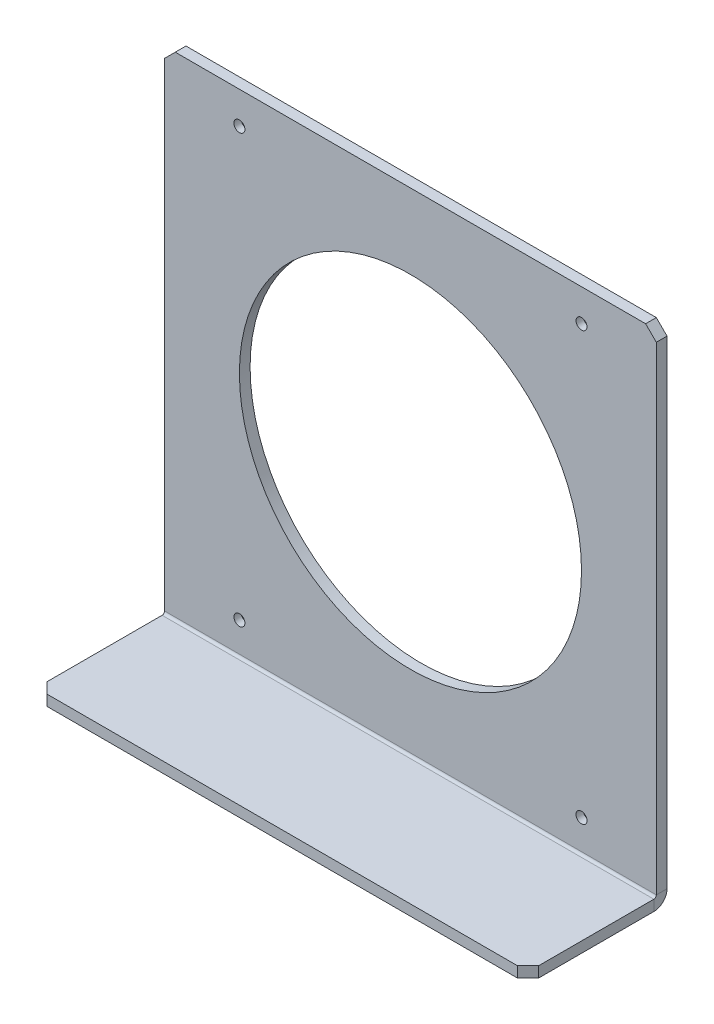
ISO-10303-21;
HEADER;
FILE_DESCRIPTION(('STEP AP214'),'2;1');
FILE_NAME('part.step','',(''),(''),'','','');
FILE_SCHEMA(('AUTOMOTIVE_DESIGN { 1 0 10303 214 1 1 1 1 }'));
ENDSEC;
DATA;
#1=APPLICATION_CONTEXT('core data for automotive mechanical design processes');
#2=APPLICATION_PROTOCOL_DEFINITION('international standard','automotive_design',2000,#1);
#3=PRODUCT_CONTEXT('',#1,'mechanical');
#4=PRODUCT('Part','Part','',(#3));
#5=PRODUCT_RELATED_PRODUCT_CATEGORY('part','',(#4));
#6=PRODUCT_DEFINITION_FORMATION('','',#4);
#7=PRODUCT_DEFINITION_CONTEXT('part definition',#1,'design');
#8=PRODUCT_DEFINITION('design','',#6,#7);
#9=PRODUCT_DEFINITION_SHAPE('','',#8);
#10=(LENGTH_UNIT() NAMED_UNIT(*) SI_UNIT(.MILLI.,.METRE.));
#11=(NAMED_UNIT(*) PLANE_ANGLE_UNIT() SI_UNIT($,.RADIAN.));
#12=(NAMED_UNIT(*) SI_UNIT($,.STERADIAN.) SOLID_ANGLE_UNIT());
#13=UNCERTAINTY_MEASURE_WITH_UNIT(LENGTH_MEASURE(1.E-05),#10,'distance_accuracy_value','');
#14=(GEOMETRIC_REPRESENTATION_CONTEXT(3) GLOBAL_UNCERTAINTY_ASSIGNED_CONTEXT((#13)) GLOBAL_UNIT_ASSIGNED_CONTEXT((#10,
#11,#12)) REPRESENTATION_CONTEXT('',''));
#15=CARTESIAN_POINT('',(0.,0.,0.));
#16=DIRECTION('',(0.,0.,1.));
#17=DIRECTION('',(1.,0.,0.));
#18=AXIS2_PLACEMENT_3D('',#15,#16,#17);
#19=CARTESIAN_POINT('',(73.025,0.,-41.275));
#20=DIRECTION('',(0.,0.,1.));
#21=DIRECTION('',(1.,0.,0.));
#22=AXIS2_PLACEMENT_3D('',#19,#20,#21);
#23=PLANE('',#22);
#24=CARTESIAN_POINT('',(0.,73.0249999999999,-41.275));
#25=DIRECTION('',(0.,0.,-1.));
#26=DIRECTION('',(-1.,0.,0.));
#27=AXIS2_PLACEMENT_3D('',#24,#25,#26);
#28=CIRCLE('',#27,50.8);
#29=CARTESIAN_POINT('',(-50.8,73.0249999999999,-41.275));
#30=VERTEX_POINT('',#29);
#31=EDGE_CURVE('E327',#30,#30,#28,.T.);
#32=ORIENTED_EDGE('',*,*,#31,.F.);
#33=EDGE_LOOP('',(#32));
#34=FACE_BOUND('',#33,.T.);
#35=DIRECTION('',(-1.,0.,0.));
#36=VECTOR('',#35,1.);
#37=CARTESIAN_POINT('',(73.025,146.05,-41.275));
#38=LINE('',#37,#36);
#39=CARTESIAN_POINT('',(69.85,146.05,-41.275));
#40=VERTEX_POINT('',#39);
#41=CARTESIAN_POINT('',(-69.85,146.05,-41.275));
#42=VERTEX_POINT('',#41);
#43=EDGE_CURVE('E215',#40,#42,#38,.T.);
#44=ORIENTED_EDGE('',*,*,#43,.F.);
#45=DIRECTION('',(-0.707106781186549,0.707106781186546,0.));
#46=VECTOR('',#45,1.);
#47=CARTESIAN_POINT('',(69.85,146.05,-41.275));
#48=LINE('',#47,#46);
#49=CARTESIAN_POINT('',(73.025,142.875,-41.275));
#50=VERTEX_POINT('',#49);
#51=EDGE_CURVE('E237',#40,#50,#48,.F.);
#52=ORIENTED_EDGE('',*,*,#51,.T.);
#53=DIRECTION('',(0.,1.,0.));
#54=VECTOR('',#53,1.);
#55=CARTESIAN_POINT('',(73.025,0.,-41.275));
#56=LINE('',#55,#54);
#57=CARTESIAN_POINT('',(73.025,0.7366,-41.275));
#58=VERTEX_POINT('',#57);
#59=EDGE_CURVE('E176',#58,#50,#56,.T.);
#60=ORIENTED_EDGE('',*,*,#59,.F.);
#61=DIRECTION('',(-1.,0.,0.));
#62=VECTOR('',#61,1.);
#63=CARTESIAN_POINT('',(73.025,0.7366,-41.275));
#64=LINE('',#63,#62);
#65=CARTESIAN_POINT('',(-73.025,0.7366,-41.275));
#66=VERTEX_POINT('',#65);
#67=EDGE_CURVE('E189',#58,#66,#64,.T.);
#68=ORIENTED_EDGE('',*,*,#67,.T.);
#69=DIRECTION('',(0.,1.,0.));
#70=VECTOR('',#69,1.);
#71=CARTESIAN_POINT('',(-73.025,0.,-41.275));
#72=LINE('',#71,#70);
#73=CARTESIAN_POINT('',(-73.025,142.875,-41.275));
#74=VERTEX_POINT('',#73);
#75=EDGE_CURVE('E190',#66,#74,#72,.T.);
#76=ORIENTED_EDGE('',*,*,#75,.T.);
#77=DIRECTION('',(-0.707106781186548,-0.707106781186548,0.));
#78=VECTOR('',#77,1.);
#79=CARTESIAN_POINT('',(-73.025,142.875,-41.275));
#80=LINE('',#79,#78);
#81=EDGE_CURVE('E226',#74,#42,#80,.F.);
#82=ORIENTED_EDGE('',*,*,#81,.T.);
#83=EDGE_LOOP('',(#44,#52,#60,#68,#76,#82));
#84=FACE_BOUND('',#83,.T.);
#85=CARTESIAN_POINT('',(50.8,9.52499999999994,-41.275));
#86=DIRECTION('',(0.,0.,-1.));
#87=DIRECTION('',(-1.,0.,0.));
#88=AXIS2_PLACEMENT_3D('',#85,#86,#87);
#89=CIRCLE('',#88,2.8575);
#90=CARTESIAN_POINT('',(47.9425,9.52499999999994,-41.275));
#91=VERTEX_POINT('',#90);
#92=EDGE_CURVE('E297',#91,#91,#89,.T.);
#93=ORIENTED_EDGE('',*,*,#92,.F.);
#94=EDGE_LOOP('',(#93));
#95=FACE_BOUND('',#94,.T.);
#96=CARTESIAN_POINT('',(-50.8,9.52499999999994,-41.275));
#97=DIRECTION('',(0.,0.,-1.));
#98=DIRECTION('',(-1.,0.,0.));
#99=AXIS2_PLACEMENT_3D('',#96,#97,#98);
#100=CIRCLE('',#99,2.8575);
#101=CARTESIAN_POINT('',(-53.6575,9.52499999999994,-41.275));
#102=VERTEX_POINT('',#101);
#103=EDGE_CURVE('E306',#102,#102,#100,.T.);
#104=ORIENTED_EDGE('',*,*,#103,.F.);
#105=EDGE_LOOP('',(#104));
#106=FACE_BOUND('',#105,.T.);
#107=CARTESIAN_POINT('',(-50.8,136.525,-41.275));
#108=DIRECTION('',(0.,0.,-1.));
#109=DIRECTION('',(-1.,0.,0.));
#110=AXIS2_PLACEMENT_3D('',#107,#108,#109);
#111=CIRCLE('',#110,2.8575);
#112=CARTESIAN_POINT('',(-53.6575,136.525,-41.275));
#113=VERTEX_POINT('',#112);
#114=EDGE_CURVE('E315',#113,#113,#111,.T.);
#115=ORIENTED_EDGE('',*,*,#114,.F.);
#116=EDGE_LOOP('',(#115));
#117=FACE_BOUND('',#116,.T.);
#118=CARTESIAN_POINT('',(50.8,136.525,-41.275));
#119=DIRECTION('',(0.,0.,-1.));
#120=DIRECTION('',(-1.,0.,0.));
#121=AXIS2_PLACEMENT_3D('',#118,#119,#120);
#122=CIRCLE('',#121,2.8575);
#123=CARTESIAN_POINT('',(47.9425,136.525,-41.275));
#124=VERTEX_POINT('',#123);
#125=EDGE_CURVE('E324',#124,#124,#122,.T.);
#126=ORIENTED_EDGE('',*,*,#125,.F.);
#127=EDGE_LOOP('',(#126));
#128=FACE_BOUND('',#127,.T.);
#129=ADVANCED_FACE('F53',(#34,#84,#95,#106,#117,#128),#23,.F.);
#130=CARTESIAN_POINT('',(73.025,0.7366,-38.1));
#131=DIRECTION('',(1.,0.,0.));
#132=DIRECTION('',(0.,0.,-1.));
#133=AXIS2_PLACEMENT_3D('',#130,#131,#132);
#134=PLANE('',#133);
#135=DIRECTION('',(0.,0.,-1.));
#136=VECTOR('',#135,1.);
#137=CARTESIAN_POINT('',(73.025,0.7366,-38.1));
#138=LINE('',#137,#136);
#139=CARTESIAN_POINT('',(73.025,0.7366,-38.1));
#140=VERTEX_POINT('',#139);
#141=EDGE_CURVE('E142',#140,#58,#138,.T.);
#142=ORIENTED_EDGE('',*,*,#141,.F.);
#143=CARTESIAN_POINT('',(73.025,0.7366,-37.3634));
#144=DIRECTION('',(-1.,0.,0.));
#145=DIRECTION('',(0.,0.,1.));
#146=AXIS2_PLACEMENT_3D('',#143,#144,#145);
#147=CIRCLE('',#146,0.7366);
#148=CARTESIAN_POINT('',(73.025,0.,-37.3634));
#149=VERTEX_POINT('',#148);
#150=EDGE_CURVE('E147',#149,#140,#147,.F.);
#151=ORIENTED_EDGE('',*,*,#150,.F.);
#152=DIRECTION('',(0.,1.,0.));
#153=VECTOR('',#152,1.);
#154=CARTESIAN_POINT('',(73.025,-3.175,-37.3633999999998));
#155=LINE('',#154,#153);
#156=CARTESIAN_POINT('',(73.025,-3.175,-37.3633999999998));
#157=VERTEX_POINT('',#156);
#158=EDGE_CURVE('E155',#157,#149,#155,.T.);
#159=ORIENTED_EDGE('',*,*,#158,.F.);
#160=CARTESIAN_POINT('',(73.025,0.7366,-37.3634));
#161=DIRECTION('',(1.,0.,0.));
#162=DIRECTION('',(0.,0.,-1.));
#163=AXIS2_PLACEMENT_3D('',#160,#161,#162);
#164=CIRCLE('',#163,3.9116);
#165=EDGE_CURVE('E149',#157,#58,#164,.T.);
#166=ORIENTED_EDGE('',*,*,#165,.T.);
#167=EDGE_LOOP('',(#142,#151,#159,#166));
#168=FACE_BOUND('',#167,.T.);
#169=ADVANCED_FACE('F144',(#168),#134,.T.);
#170=CARTESIAN_POINT('',(73.025,-3.175,-37.3633999999998));
#171=DIRECTION('',(1.,0.,0.));
#172=DIRECTION('',(0.,0.,-1.));
#173=AXIS2_PLACEMENT_3D('',#170,#171,#172);
#174=PLANE('',#173);
#175=ORIENTED_EDGE('',*,*,#59,.T.);
#176=DIRECTION('',(0.,0.,1.));
#177=VECTOR('',#176,1.);
#178=CARTESIAN_POINT('',(73.025,142.875,-37.3633999999998));
#179=LINE('',#178,#177);
#180=CARTESIAN_POINT('',(73.025,142.875,-38.1));
#181=VERTEX_POINT('',#180);
#182=EDGE_CURVE('E175',#50,#181,#179,.T.);
#183=ORIENTED_EDGE('',*,*,#182,.T.);
#184=DIRECTION('',(0.,1.,0.));
#185=VECTOR('',#184,1.);
#186=CARTESIAN_POINT('',(73.025,0.,-38.1));
#187=LINE('',#186,#185);
#188=EDGE_CURVE('E163',#140,#181,#187,.T.);
#189=ORIENTED_EDGE('',*,*,#188,.F.);
#190=ORIENTED_EDGE('',*,*,#141,.T.);
#191=EDGE_LOOP('',(#175,#183,#189,#190));
#192=FACE_BOUND('',#191,.T.);
#193=ADVANCED_FACE('F173',(#192),#174,.T.);
#194=CARTESIAN_POINT('',(-73.025,0.,-37.3634));
#195=DIRECTION('',(-1.,0.,0.));
#196=DIRECTION('',(0.,0.,1.));
#197=AXIS2_PLACEMENT_3D('',#194,#195,#196);
#198=PLANE('',#197);
#199=DIRECTION('',(0.,-1.,0.));
#200=VECTOR('',#199,1.);
#201=CARTESIAN_POINT('',(-73.025,0.,-37.3634));
#202=LINE('',#201,#200);
#203=CARTESIAN_POINT('',(-73.025,0.,-37.3634));
#204=VERTEX_POINT('',#203);
#205=CARTESIAN_POINT('',(-73.025,-3.175,-37.3633999999998));
#206=VERTEX_POINT('',#205);
#207=EDGE_CURVE('E219',#204,#206,#202,.T.);
#208=ORIENTED_EDGE('',*,*,#207,.F.);
#209=CARTESIAN_POINT('',(-73.025,0.7366,-37.3634));
#210=DIRECTION('',(-1.,0.,0.));
#211=DIRECTION('',(0.,0.,1.));
#212=AXIS2_PLACEMENT_3D('',#209,#210,#211);
#213=CIRCLE('',#212,0.7366);
#214=CARTESIAN_POINT('',(-73.025,0.7366,-38.1));
#215=VERTEX_POINT('',#214);
#216=EDGE_CURVE('E195',#204,#215,#213,.F.);
#217=ORIENTED_EDGE('',*,*,#216,.T.);
#218=DIRECTION('',(0.,0.,1.));
#219=VECTOR('',#218,1.);
#220=CARTESIAN_POINT('',(-73.025,0.7366,-41.275));
#221=LINE('',#220,#219);
#222=EDGE_CURVE('E217',#66,#215,#221,.T.);
#223=ORIENTED_EDGE('',*,*,#222,.F.);
#224=CARTESIAN_POINT('',(-73.025,0.7366,-37.3634));
#225=DIRECTION('',(1.,0.,0.));
#226=DIRECTION('',(0.,0.,-1.));
#227=AXIS2_PLACEMENT_3D('',#224,#225,#226);
#228=CIRCLE('',#227,3.9116);
#229=EDGE_CURVE('E201',#206,#66,#228,.T.);
#230=ORIENTED_EDGE('',*,*,#229,.F.);
#231=EDGE_LOOP('',(#208,#217,#223,#230));
#232=FACE_BOUND('',#231,.T.);
#233=ADVANCED_FACE('F281',(#232),#198,.T.);
#234=CARTESIAN_POINT('',(-73.025,0.7366,-41.275));
#235=DIRECTION('',(-1.,0.,0.));
#236=DIRECTION('',(0.,0.,1.));
#237=AXIS2_PLACEMENT_3D('',#234,#235,#236);
#238=PLANE('',#237);
#239=DIRECTION('',(0.,0.,-1.));
#240=VECTOR('',#239,1.);
#241=CARTESIAN_POINT('',(-73.025,-3.175,0.));
#242=LINE('',#241,#240);
#243=CARTESIAN_POINT('',(-73.025,-3.175,-3.17500000000003));
#244=VERTEX_POINT('',#243);
#245=EDGE_CURVE('E199',#244,#206,#242,.T.);
#246=ORIENTED_EDGE('',*,*,#245,.F.);
#247=DIRECTION('',(0.,1.,0.));
#248=VECTOR('',#247,1.);
#249=CARTESIAN_POINT('',(-73.025,0.7366,-3.17500000000003));
#250=LINE('',#249,#248);
#251=CARTESIAN_POINT('',(-73.025,0.,-3.17500000000002));
#252=VERTEX_POINT('',#251);
#253=EDGE_CURVE('E242',#244,#252,#250,.T.);
#254=ORIENTED_EDGE('',*,*,#253,.T.);
#255=DIRECTION('',(0.,0.,-1.));
#256=VECTOR('',#255,1.);
#257=CARTESIAN_POINT('',(-73.025,0.,0.));
#258=LINE('',#257,#256);
#259=EDGE_CURVE('E197',#252,#204,#258,.T.);
#260=ORIENTED_EDGE('',*,*,#259,.T.);
#261=ORIENTED_EDGE('',*,*,#207,.T.);
#262=EDGE_LOOP('',(#246,#254,#260,#261));
#263=FACE_BOUND('',#262,.T.);
#264=ADVANCED_FACE('F275',(#263),#238,.T.);
#265=CARTESIAN_POINT('',(73.025,146.05,-38.1));
#266=DIRECTION('',(0.,1.,0.));
#267=DIRECTION('',(0.,0.,1.));
#268=AXIS2_PLACEMENT_3D('',#265,#266,#267);
#269=PLANE('',#268);
#270=DIRECTION('',(-1.,0.,0.));
#271=VECTOR('',#270,1.);
#272=CARTESIAN_POINT('',(73.025,146.05,-38.1));
#273=LINE('',#272,#271);
#274=CARTESIAN_POINT('',(69.85,146.05,-38.1));
#275=VERTEX_POINT('',#274);
#276=CARTESIAN_POINT('',(-69.85,146.05,-38.1));
#277=VERTEX_POINT('',#276);
#278=EDGE_CURVE('E170',#275,#277,#273,.T.);
#279=ORIENTED_EDGE('',*,*,#278,.F.);
#280=DIRECTION('',(0.,0.,-1.));
#281=VECTOR('',#280,1.);
#282=CARTESIAN_POINT('',(69.85,146.05,-38.1));
#283=LINE('',#282,#281);
#284=EDGE_CURVE('E234',#275,#40,#283,.T.);
#285=ORIENTED_EDGE('',*,*,#284,.T.);
#286=ORIENTED_EDGE('',*,*,#43,.T.);
#287=DIRECTION('',(0.,0.,1.));
#288=VECTOR('',#287,1.);
#289=CARTESIAN_POINT('',(-69.85,146.05,-38.1));
#290=LINE('',#289,#288);
#291=EDGE_CURVE('E229',#42,#277,#290,.T.);
#292=ORIENTED_EDGE('',*,*,#291,.T.);
#293=EDGE_LOOP('',(#279,#285,#286,#292));
#294=FACE_BOUND('',#293,.T.);
#295=ADVANCED_FACE('F338',(#294),#269,.T.);
#296=CARTESIAN_POINT('',(73.025,0.,-38.1));
#297=DIRECTION('',(0.,0.,1.));
#298=DIRECTION('',(1.,0.,0.));
#299=AXIS2_PLACEMENT_3D('',#296,#297,#298);
#300=PLANE('',#299);
#301=CARTESIAN_POINT('',(0.,73.0249999999999,-38.1));
#302=DIRECTION('',(0.,0.,1.));
#303=DIRECTION('',(1.,0.,0.));
#304=AXIS2_PLACEMENT_3D('',#301,#302,#303);
#305=CIRCLE('',#304,50.8);
#306=CARTESIAN_POINT('',(50.8,73.0249999999999,-38.1));
#307=VERTEX_POINT('',#306);
#308=EDGE_CURVE('E58',#307,#307,#305,.T.);
#309=ORIENTED_EDGE('',*,*,#308,.F.);
#310=EDGE_LOOP('',(#309));
#311=FACE_BOUND('',#310,.T.);
#312=CARTESIAN_POINT('',(50.8,136.525,-38.1));
#313=DIRECTION('',(0.,0.,1.));
#314=DIRECTION('',(1.,0.,0.));
#315=AXIS2_PLACEMENT_3D('',#312,#313,#314);
#316=CIRCLE('',#315,1.63195);
#317=CARTESIAN_POINT('',(52.43195,136.525,-38.1));
#318=VERTEX_POINT('',#317);
#319=EDGE_CURVE('E318',#318,#318,#316,.T.);
#320=ORIENTED_EDGE('',*,*,#319,.F.);
#321=EDGE_LOOP('',(#320));
#322=FACE_BOUND('',#321,.T.);
#323=CARTESIAN_POINT('',(-50.8,136.525,-38.1));
#324=DIRECTION('',(0.,0.,1.));
#325=DIRECTION('',(1.,0.,0.));
#326=AXIS2_PLACEMENT_3D('',#323,#324,#325);
#327=CIRCLE('',#326,1.63195);
#328=CARTESIAN_POINT('',(-49.16805,136.525,-38.1));
#329=VERTEX_POINT('',#328);
#330=EDGE_CURVE('E309',#329,#329,#327,.T.);
#331=ORIENTED_EDGE('',*,*,#330,.F.);
#332=EDGE_LOOP('',(#331));
#333=FACE_BOUND('',#332,.T.);
#334=CARTESIAN_POINT('',(-50.8,9.52499999999994,-38.1));
#335=DIRECTION('',(0.,0.,1.));
#336=DIRECTION('',(1.,0.,0.));
#337=AXIS2_PLACEMENT_3D('',#334,#335,#336);
#338=CIRCLE('',#337,1.63195);
#339=CARTESIAN_POINT('',(-49.16805,9.52499999999994,-38.1));
#340=VERTEX_POINT('',#339);
#341=EDGE_CURVE('E300',#340,#340,#338,.T.);
#342=ORIENTED_EDGE('',*,*,#341,.F.);
#343=EDGE_LOOP('',(#342));
#344=FACE_BOUND('',#343,.T.);
#345=CARTESIAN_POINT('',(50.8,9.52499999999994,-38.1));
#346=DIRECTION('',(0.,0.,1.));
#347=DIRECTION('',(1.,0.,0.));
#348=AXIS2_PLACEMENT_3D('',#345,#346,#347);
#349=CIRCLE('',#348,1.63195);
#350=CARTESIAN_POINT('',(52.43195,9.52499999999994,-38.1));
#351=VERTEX_POINT('',#350);
#352=EDGE_CURVE('E193',#351,#351,#349,.T.);
#353=ORIENTED_EDGE('',*,*,#352,.F.);
#354=EDGE_LOOP('',(#353));
#355=FACE_BOUND('',#354,.T.);
#356=ORIENTED_EDGE('',*,*,#188,.T.);
#357=DIRECTION('',(0.707106781186549,-0.707106781186546,0.));
#358=VECTOR('',#357,1.);
#359=CARTESIAN_POINT('',(144.4625,71.4375000000003,-38.1));
#360=LINE('',#359,#358);
#361=EDGE_CURVE('E240',#181,#275,#360,.F.);
#362=ORIENTED_EDGE('',*,*,#361,.T.);
#363=ORIENTED_EDGE('',*,*,#278,.T.);
#364=DIRECTION('',(0.707106781186548,0.707106781186548,0.));
#365=VECTOR('',#364,1.);
#366=CARTESIAN_POINT('',(-71.4374999999999,144.4625,-38.1));
#367=LINE('',#366,#365);
#368=CARTESIAN_POINT('',(-73.025,142.875,-38.1));
#369=VERTEX_POINT('',#368);
#370=EDGE_CURVE('E232',#277,#369,#367,.F.);
#371=ORIENTED_EDGE('',*,*,#370,.T.);
#372=DIRECTION('',(0.,1.,0.));
#373=VECTOR('',#372,1.);
#374=CARTESIAN_POINT('',(-73.025,0.,-38.1));
#375=LINE('',#374,#373);
#376=EDGE_CURVE('E166',#215,#369,#375,.T.);
#377=ORIENTED_EDGE('',*,*,#376,.F.);
#378=DIRECTION('',(-1.,0.,0.));
#379=VECTOR('',#378,1.);
#380=CARTESIAN_POINT('',(73.025,0.7366,-38.1));
#381=LINE('',#380,#379);
#382=EDGE_CURVE('E161',#140,#215,#381,.T.);
#383=ORIENTED_EDGE('',*,*,#382,.F.);
#384=EDGE_LOOP('',(#356,#362,#363,#371,#377,#383));
#385=FACE_BOUND('',#384,.T.);
#386=ADVANCED_FACE('F162',(#311,#322,#333,#344,#355,#385),#300,.T.);
#387=CARTESIAN_POINT('',(73.025,0.7366,-37.3634));
#388=DIRECTION('',(-1.,0.,0.));
#389=DIRECTION('',(0.,0.,1.));
#390=AXIS2_PLACEMENT_3D('',#387,#388,#389);
#391=CYLINDRICAL_SURFACE('',#390,0.7366);
#392=ORIENTED_EDGE('',*,*,#216,.F.);
#393=DIRECTION('',(-1.,0.,0.));
#394=VECTOR('',#393,1.);
#395=CARTESIAN_POINT('',(73.025,0.,-37.3634));
#396=LINE('',#395,#394);
#397=EDGE_CURVE('E171',#149,#204,#396,.T.);
#398=ORIENTED_EDGE('',*,*,#397,.F.);
#399=ORIENTED_EDGE('',*,*,#150,.T.);
#400=ORIENTED_EDGE('',*,*,#382,.T.);
#401=EDGE_LOOP('',(#392,#398,#399,#400));
#402=FACE_BOUND('',#401,.T.);
#403=ADVANCED_FACE('F179',(#402),#391,.F.);
#404=CARTESIAN_POINT('',(73.025,0.,0.));
#405=DIRECTION('',(0.,1.,0.));
#406=DIRECTION('',(0.,0.,1.));
#407=AXIS2_PLACEMENT_3D('',#404,#405,#406);
#408=PLANE('',#407);
#409=DIRECTION('',(-1.,0.,0.));
#410=VECTOR('',#409,1.);
#411=CARTESIAN_POINT('',(73.025,0.,0.));
#412=LINE('',#411,#410);
#413=CARTESIAN_POINT('',(69.85,0.,0.));
#414=VERTEX_POINT('',#413);
#415=CARTESIAN_POINT('',(-69.85,0.,0.));
#416=VERTEX_POINT('',#415);
#417=EDGE_CURVE('E211',#414,#416,#412,.T.);
#418=ORIENTED_EDGE('',*,*,#417,.F.);
#419=DIRECTION('',(0.707106781186548,0.,-0.707106781186548));
#420=VECTOR('',#419,1.);
#421=CARTESIAN_POINT('',(71.4375,0.,-1.58750000000001));
#422=LINE('',#421,#420);
#423=CARTESIAN_POINT('',(73.025,0.,-3.17500000000002));
#424=VERTEX_POINT('',#423);
#425=EDGE_CURVE('E77',#414,#424,#422,.T.);
#426=ORIENTED_EDGE('',*,*,#425,.T.);
#427=DIRECTION('',(0.,0.,-1.));
#428=VECTOR('',#427,1.);
#429=CARTESIAN_POINT('',(73.025,0.,0.));
#430=LINE('',#429,#428);
#431=EDGE_CURVE('E181',#424,#149,#430,.T.);
#432=ORIENTED_EDGE('',*,*,#431,.T.);
#433=ORIENTED_EDGE('',*,*,#397,.T.);
#434=ORIENTED_EDGE('',*,*,#259,.F.);
#435=DIRECTION('',(-0.707106781186546,0.,-0.707106781186549));
#436=VECTOR('',#435,1.);
#437=CARTESIAN_POINT('',(1.58749999999969,0.,71.4375));
#438=LINE('',#437,#436);
#439=EDGE_CURVE('E245',#252,#416,#438,.F.);
#440=ORIENTED_EDGE('',*,*,#439,.T.);
#441=EDGE_LOOP('',(#418,#426,#432,#433,#434,#440));
#442=FACE_BOUND('',#441,.T.);
#443=ADVANCED_FACE('F263',(#442),#408,.T.);
#444=CARTESIAN_POINT('',(73.025,-3.175,0.));
#445=DIRECTION('',(0.,0.,1.));
#446=DIRECTION('',(1.,0.,0.));
#447=AXIS2_PLACEMENT_3D('',#444,#445,#446);
#448=PLANE('',#447);
#449=DIRECTION('',(-1.,0.,0.));
#450=VECTOR('',#449,1.);
#451=CARTESIAN_POINT('',(73.025,-3.175,0.));
#452=LINE('',#451,#450);
#453=CARTESIAN_POINT('',(69.85,-3.175,0.));
#454=VERTEX_POINT('',#453);
#455=CARTESIAN_POINT('',(-69.85,-3.175,0.));
#456=VERTEX_POINT('',#455);
#457=EDGE_CURVE('E209',#454,#456,#452,.T.);
#458=ORIENTED_EDGE('',*,*,#457,.F.);
#459=DIRECTION('',(0.,1.,0.));
#460=VECTOR('',#459,1.);
#461=CARTESIAN_POINT('',(69.85,0.,0.));
#462=LINE('',#461,#460);
#463=EDGE_CURVE('E253',#454,#414,#462,.T.);
#464=ORIENTED_EDGE('',*,*,#463,.T.);
#465=ORIENTED_EDGE('',*,*,#417,.T.);
#466=DIRECTION('',(0.,-1.,0.));
#467=VECTOR('',#466,1.);
#468=CARTESIAN_POINT('',(-69.85,-3.175,0.));
#469=LINE('',#468,#467);
#470=EDGE_CURVE('E248',#416,#456,#469,.T.);
#471=ORIENTED_EDGE('',*,*,#470,.T.);
#472=EDGE_LOOP('',(#458,#464,#465,#471));
#473=FACE_BOUND('',#472,.T.);
#474=ADVANCED_FACE('F260',(#473),#448,.T.);
#475=CARTESIAN_POINT('',(73.025,-3.175,0.));
#476=DIRECTION('',(0.,1.,0.));
#477=DIRECTION('',(0.,0.,1.));
#478=AXIS2_PLACEMENT_3D('',#475,#476,#477);
#479=PLANE('',#478);
#480=DIRECTION('',(0.,0.,-1.));
#481=VECTOR('',#480,1.);
#482=CARTESIAN_POINT('',(73.025,-3.175,0.));
#483=LINE('',#482,#481);
#484=CARTESIAN_POINT('',(73.025,-3.175,-3.17500000000002));
#485=VERTEX_POINT('',#484);
#486=EDGE_CURVE('E183',#485,#157,#483,.T.);
#487=ORIENTED_EDGE('',*,*,#486,.F.);
#488=DIRECTION('',(-0.707106781186548,0.,0.707106781186548));
#489=VECTOR('',#488,1.);
#490=CARTESIAN_POINT('',(69.85,-3.175,0.));
#491=LINE('',#490,#489);
#492=EDGE_CURVE('E11',#485,#454,#491,.T.);
#493=ORIENTED_EDGE('',*,*,#492,.T.);
#494=ORIENTED_EDGE('',*,*,#457,.T.);
#495=DIRECTION('',(0.707106781186546,0.,0.707106781186549));
#496=VECTOR('',#495,1.);
#497=CARTESIAN_POINT('',(-73.025,-3.175,-3.17500000000003));
#498=LINE('',#497,#496);
#499=EDGE_CURVE('E251',#456,#244,#498,.F.);
#500=ORIENTED_EDGE('',*,*,#499,.T.);
#501=ORIENTED_EDGE('',*,*,#245,.T.);
#502=DIRECTION('',(-1.,0.,0.));
#503=VECTOR('',#502,1.);
#504=CARTESIAN_POINT('',(73.025,-3.175,-37.3633999999998));
#505=LINE('',#504,#503);
#506=EDGE_CURVE('E206',#157,#206,#505,.T.);
#507=ORIENTED_EDGE('',*,*,#506,.F.);
#508=EDGE_LOOP('',(#487,#493,#494,#500,#501,#507));
#509=FACE_BOUND('',#508,.T.);
#510=ADVANCED_FACE('F272',(#509),#479,.F.);
#511=CARTESIAN_POINT('',(73.025,0.7366,-37.3634));
#512=DIRECTION('',(-1.,0.,0.));
#513=DIRECTION('',(0.,0.,1.));
#514=AXIS2_PLACEMENT_3D('',#511,#512,#513);
#515=CYLINDRICAL_SURFACE('',#514,3.9116);
#516=ORIENTED_EDGE('',*,*,#229,.T.);
#517=ORIENTED_EDGE('',*,*,#67,.F.);
#518=ORIENTED_EDGE('',*,*,#165,.F.);
#519=ORIENTED_EDGE('',*,*,#506,.T.);
#520=EDGE_LOOP('',(#516,#517,#518,#519));
#521=FACE_BOUND('',#520,.T.);
#522=ADVANCED_FACE('F280',(#521),#515,.T.);
#523=CARTESIAN_POINT('',(73.025,0.7366,-37.3634));
#524=DIRECTION('',(-1.,0.,0.));
#525=DIRECTION('',(0.,0.,1.));
#526=AXIS2_PLACEMENT_3D('',#523,#524,#525);
#527=PLANE('',#526);
#528=ORIENTED_EDGE('',*,*,#431,.F.);
#529=DIRECTION('',(0.,-1.,0.));
#530=VECTOR('',#529,1.);
#531=CARTESIAN_POINT('',(73.025,-3.175,-3.17500000000002));
#532=LINE('',#531,#530);
#533=EDGE_CURVE('E63',#424,#485,#532,.T.);
#534=ORIENTED_EDGE('',*,*,#533,.T.);
#535=ORIENTED_EDGE('',*,*,#486,.T.);
#536=ORIENTED_EDGE('',*,*,#158,.T.);
#537=EDGE_LOOP('',(#528,#534,#535,#536));
#538=FACE_BOUND('',#537,.T.);
#539=ADVANCED_FACE('F546',(#538),#527,.F.);
#540=CARTESIAN_POINT('',(-73.025,0.7366,-37.3634));
#541=DIRECTION('',(-1.,0.,0.));
#542=DIRECTION('',(0.,0.,1.));
#543=AXIS2_PLACEMENT_3D('',#540,#541,#542);
#544=PLANE('',#543);
#545=ORIENTED_EDGE('',*,*,#376,.T.);
#546=DIRECTION('',(0.,0.,-1.));
#547=VECTOR('',#546,1.);
#548=CARTESIAN_POINT('',(-73.025,142.875,-37.3634));
#549=LINE('',#548,#547);
#550=EDGE_CURVE('E154',#369,#74,#549,.T.);
#551=ORIENTED_EDGE('',*,*,#550,.T.);
#552=ORIENTED_EDGE('',*,*,#75,.F.);
#553=ORIENTED_EDGE('',*,*,#222,.T.);
#554=EDGE_LOOP('',(#545,#551,#552,#553));
#555=FACE_BOUND('',#554,.T.);
#556=ADVANCED_FACE('F284',(#555),#544,.T.);
#557=CARTESIAN_POINT('',(-73.025,142.875,-37.3634));
#558=DIRECTION('',(0.707106781186548,-0.707106781186548,0.));
#559=DIRECTION('',(0.,0.,-1.));
#560=AXIS2_PLACEMENT_3D('',#557,#558,#559);
#561=PLANE('',#560);
#562=ORIENTED_EDGE('',*,*,#370,.F.);
#563=ORIENTED_EDGE('',*,*,#291,.F.);
#564=ORIENTED_EDGE('',*,*,#81,.F.);
#565=ORIENTED_EDGE('',*,*,#550,.F.);
#566=EDGE_LOOP('',(#562,#563,#564,#565));
#567=FACE_BOUND('',#566,.T.);
#568=ADVANCED_FACE('F378',(#567),#561,.F.);
#569=CARTESIAN_POINT('',(69.85,146.05,-38.1));
#570=DIRECTION('',(-0.707106781186546,-0.707106781186549,0.));
#571=DIRECTION('',(0.,0.,-1.));
#572=AXIS2_PLACEMENT_3D('',#569,#570,#571);
#573=PLANE('',#572);
#574=ORIENTED_EDGE('',*,*,#361,.F.);
#575=ORIENTED_EDGE('',*,*,#182,.F.);
#576=ORIENTED_EDGE('',*,*,#51,.F.);
#577=ORIENTED_EDGE('',*,*,#284,.F.);
#578=EDGE_LOOP('',(#574,#575,#576,#577));
#579=FACE_BOUND('',#578,.T.);
#580=ADVANCED_FACE('F384',(#579),#573,.F.);
#581=CARTESIAN_POINT('',(-73.025,0.7366,-3.17500000000003));
#582=DIRECTION('',(0.707106781186549,0.,-0.707106781186546));
#583=DIRECTION('',(0.,1.,0.));
#584=AXIS2_PLACEMENT_3D('',#581,#582,#583);
#585=PLANE('',#584);
#586=ORIENTED_EDGE('',*,*,#499,.F.);
#587=ORIENTED_EDGE('',*,*,#470,.F.);
#588=ORIENTED_EDGE('',*,*,#439,.F.);
#589=ORIENTED_EDGE('',*,*,#253,.F.);
#590=EDGE_LOOP('',(#586,#587,#588,#589));
#591=FACE_BOUND('',#590,.T.);
#592=ADVANCED_FACE('F269',(#591),#585,.F.);
#593=CARTESIAN_POINT('',(69.85,-3.175,0.));
#594=DIRECTION('',(0.707106781186547,0.,0.707106781186547));
#595=DIRECTION('',(0.,-1.,0.));
#596=AXIS2_PLACEMENT_3D('',#593,#594,#595);
#597=PLANE('',#596);
#598=ORIENTED_EDGE('',*,*,#492,.F.);
#599=ORIENTED_EDGE('',*,*,#533,.F.);
#600=ORIENTED_EDGE('',*,*,#425,.F.);
#601=ORIENTED_EDGE('',*,*,#463,.F.);
#602=EDGE_LOOP('',(#598,#599,#600,#601));
#603=FACE_BOUND('',#602,.T.);
#604=ADVANCED_FACE('F56',(#603),#597,.T.);
#605=CARTESIAN_POINT('',(50.8,9.52499999999994,-41.275));
#606=DIRECTION('',(0.,0.,-1.));
#607=DIRECTION('',(-1.,0.,0.));
#608=AXIS2_PLACEMENT_3D('',#605,#606,#607);
#609=CYLINDRICAL_SURFACE('',#608,1.63195);
#610=CARTESIAN_POINT('',(50.8,9.52499999999994,-40.2466414470107));
#611=DIRECTION('',(0.,0.,-1.));
#612=DIRECTION('',(-1.,0.,0.));
#613=AXIS2_PLACEMENT_3D('',#610,#611,#612);
#614=CIRCLE('',#613,1.63195);
#615=CARTESIAN_POINT('',(49.16805,9.52499999999994,-40.2466414470107));
#616=VERTEX_POINT('',#615);
#617=EDGE_CURVE('E294',#616,#616,#614,.T.);
#618=ORIENTED_EDGE('',*,*,#617,.T.);
#619=EDGE_LOOP('',(#618));
#620=FACE_BOUND('',#619,.T.);
#621=ORIENTED_EDGE('',*,*,#352,.T.);
#622=EDGE_LOOP('',(#621));
#623=FACE_BOUND('',#622,.T.);
#624=ADVANCED_FACE('F348',(#620,#623),#609,.F.);
#625=CARTESIAN_POINT('',(50.8,9.52499999999994,-41.275));
#626=DIRECTION('',(0.,0.,-1.));
#627=DIRECTION('',(-1.,0.,0.));
#628=AXIS2_PLACEMENT_3D('',#625,#626,#627);
#629=CONICAL_SURFACE('',#628,2.8575,0.872664625997165);
#630=ORIENTED_EDGE('',*,*,#617,.F.);
#631=EDGE_LOOP('',(#630));
#632=FACE_BOUND('',#631,.T.);
#633=ORIENTED_EDGE('',*,*,#92,.T.);
#634=EDGE_LOOP('',(#633));
#635=FACE_BOUND('',#634,.T.);
#636=ADVANCED_FACE('F350',(#632,#635),#629,.F.);
#637=CARTESIAN_POINT('',(-50.8,9.52499999999994,-41.275));
#638=DIRECTION('',(0.,0.,-1.));
#639=DIRECTION('',(-1.,0.,0.));
#640=AXIS2_PLACEMENT_3D('',#637,#638,#639);
#641=CYLINDRICAL_SURFACE('',#640,1.63195);
#642=CARTESIAN_POINT('',(-50.8,9.52499999999994,-40.2466414470107));
#643=DIRECTION('',(0.,0.,-1.));
#644=DIRECTION('',(-1.,0.,0.));
#645=AXIS2_PLACEMENT_3D('',#642,#643,#644);
#646=CIRCLE('',#645,1.63195);
#647=CARTESIAN_POINT('',(-52.43195,9.52499999999994,-40.2466414470107));
#648=VERTEX_POINT('',#647);
#649=EDGE_CURVE('E303',#648,#648,#646,.T.);
#650=ORIENTED_EDGE('',*,*,#649,.T.);
#651=EDGE_LOOP('',(#650));
#652=FACE_BOUND('',#651,.T.);
#653=ORIENTED_EDGE('',*,*,#341,.T.);
#654=EDGE_LOOP('',(#653));
#655=FACE_BOUND('',#654,.T.);
#656=ADVANCED_FACE('F357',(#652,#655),#641,.F.);
#657=CARTESIAN_POINT('',(-50.8,9.52499999999994,-41.275));
#658=DIRECTION('',(0.,0.,-1.));
#659=DIRECTION('',(-1.,0.,0.));
#660=AXIS2_PLACEMENT_3D('',#657,#658,#659);
#661=CONICAL_SURFACE('',#660,2.8575,0.872664625997165);
#662=ORIENTED_EDGE('',*,*,#649,.F.);
#663=EDGE_LOOP('',(#662));
#664=FACE_BOUND('',#663,.T.);
#665=ORIENTED_EDGE('',*,*,#103,.T.);
#666=EDGE_LOOP('',(#665));
#667=FACE_BOUND('',#666,.T.);
#668=ADVANCED_FACE('F429',(#664,#667),#661,.F.);
#669=CARTESIAN_POINT('',(-50.8,136.525,-41.275));
#670=DIRECTION('',(0.,0.,-1.));
#671=DIRECTION('',(-1.,0.,0.));
#672=AXIS2_PLACEMENT_3D('',#669,#670,#671);
#673=CYLINDRICAL_SURFACE('',#672,1.63195);
#674=CARTESIAN_POINT('',(-50.8,136.525,-40.2466414470107));
#675=DIRECTION('',(0.,0.,-1.));
#676=DIRECTION('',(-1.,0.,0.));
#677=AXIS2_PLACEMENT_3D('',#674,#675,#676);
#678=CIRCLE('',#677,1.63195);
#679=CARTESIAN_POINT('',(-52.43195,136.525,-40.2466414470107));
#680=VERTEX_POINT('',#679);
#681=EDGE_CURVE('E312',#680,#680,#678,.T.);
#682=ORIENTED_EDGE('',*,*,#681,.T.);
#683=EDGE_LOOP('',(#682));
#684=FACE_BOUND('',#683,.T.);
#685=ORIENTED_EDGE('',*,*,#330,.T.);
#686=EDGE_LOOP('',(#685));
#687=FACE_BOUND('',#686,.T.);
#688=ADVANCED_FACE('F439',(#684,#687),#673,.F.);
#689=CARTESIAN_POINT('',(-50.8,136.525,-41.275));
#690=DIRECTION('',(0.,0.,-1.));
#691=DIRECTION('',(-1.,0.,0.));
#692=AXIS2_PLACEMENT_3D('',#689,#690,#691);
#693=CONICAL_SURFACE('',#692,2.8575,0.872664625997165);
#694=ORIENTED_EDGE('',*,*,#681,.F.);
#695=EDGE_LOOP('',(#694));
#696=FACE_BOUND('',#695,.T.);
#697=ORIENTED_EDGE('',*,*,#114,.T.);
#698=EDGE_LOOP('',(#697));
#699=FACE_BOUND('',#698,.T.);
#700=ADVANCED_FACE('F449',(#696,#699),#693,.F.);
#701=CARTESIAN_POINT('',(50.8,136.525,-41.275));
#702=DIRECTION('',(0.,0.,-1.));
#703=DIRECTION('',(-1.,0.,0.));
#704=AXIS2_PLACEMENT_3D('',#701,#702,#703);
#705=CYLINDRICAL_SURFACE('',#704,1.63195);
#706=CARTESIAN_POINT('',(50.8,136.525,-40.2466414470107));
#707=DIRECTION('',(0.,0.,-1.));
#708=DIRECTION('',(-1.,0.,0.));
#709=AXIS2_PLACEMENT_3D('',#706,#707,#708);
#710=CIRCLE('',#709,1.63195);
#711=CARTESIAN_POINT('',(49.16805,136.525,-40.2466414470107));
#712=VERTEX_POINT('',#711);
#713=EDGE_CURVE('E321',#712,#712,#710,.T.);
#714=ORIENTED_EDGE('',*,*,#713,.T.);
#715=EDGE_LOOP('',(#714));
#716=FACE_BOUND('',#715,.T.);
#717=ORIENTED_EDGE('',*,*,#319,.T.);
#718=EDGE_LOOP('',(#717));
#719=FACE_BOUND('',#718,.T.);
#720=ADVANCED_FACE('F459',(#716,#719),#705,.F.);
#721=CARTESIAN_POINT('',(50.8,136.525,-41.275));
#722=DIRECTION('',(0.,0.,-1.));
#723=DIRECTION('',(-1.,0.,0.));
#724=AXIS2_PLACEMENT_3D('',#721,#722,#723);
#725=CONICAL_SURFACE('',#724,2.8575,0.872664625997165);
#726=ORIENTED_EDGE('',*,*,#713,.F.);
#727=EDGE_LOOP('',(#726));
#728=FACE_BOUND('',#727,.T.);
#729=ORIENTED_EDGE('',*,*,#125,.T.);
#730=EDGE_LOOP('',(#729));
#731=FACE_BOUND('',#730,.T.);
#732=ADVANCED_FACE('F469',(#728,#731),#725,.F.);
#733=CARTESIAN_POINT('',(0.,73.0249999999999,0.));
#734=DIRECTION('',(0.,0.,-1.));
#735=DIRECTION('',(-1.,0.,0.));
#736=AXIS2_PLACEMENT_3D('',#733,#734,#735);
#737=CYLINDRICAL_SURFACE('',#736,50.8);
#738=ORIENTED_EDGE('',*,*,#308,.T.);
#739=EDGE_LOOP('',(#738));
#740=FACE_BOUND('',#739,.T.);
#741=ORIENTED_EDGE('',*,*,#31,.T.);
#742=EDGE_LOOP('',(#741));
#743=FACE_BOUND('',#742,.T.);
#744=ADVANCED_FACE('F334',(#740,#743),#737,.F.);
#745=CLOSED_SHELL('',(#129,#169,#193,#233,#264,#295,#386,#403,#443,#474,#510,#522,#539,#556,
#568,#580,#592,#604,#624,#636,#656,#668,#688,#700,#720,#732,#744));
#746=MANIFOLD_SOLID_BREP('B2',#745);
#747=ADVANCED_BREP_SHAPE_REPRESENTATION('',(#18,#746),#14);
#748=SHAPE_DEFINITION_REPRESENTATION(#9,#747);
ENDSEC;
END-ISO-10303-21;
